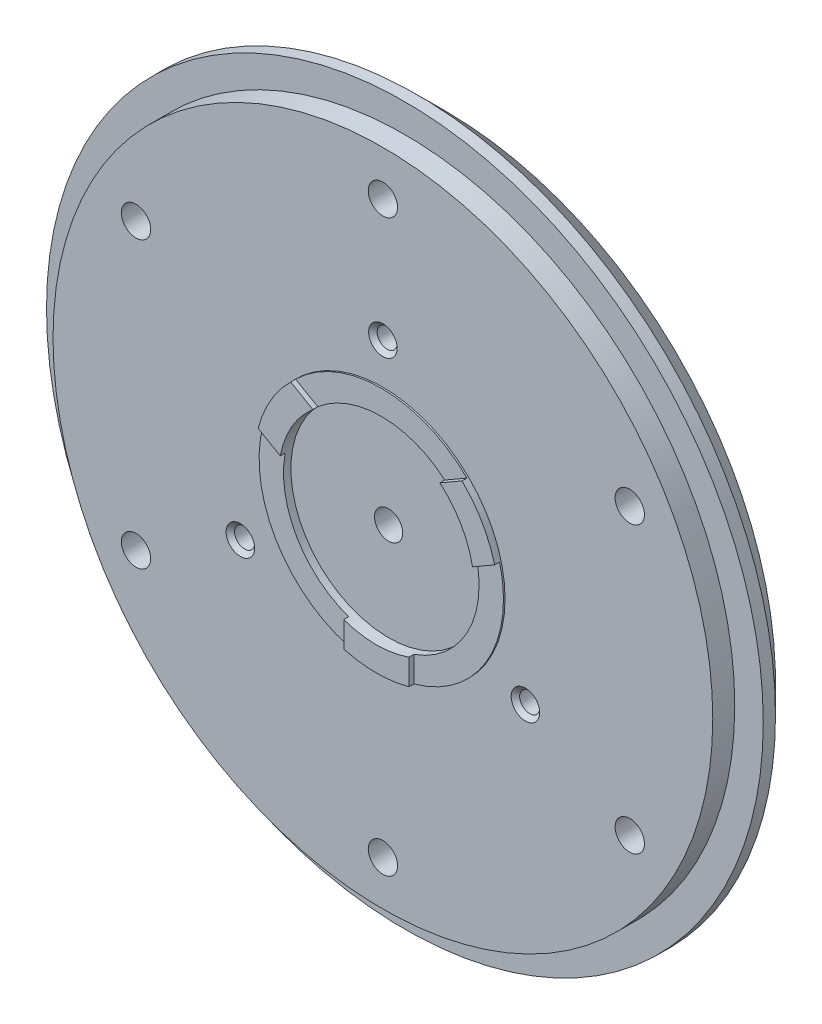
ISO-10303-21;
HEADER;
FILE_DESCRIPTION(('STEP AP214'),'2;1');
FILE_NAME('part.step','',(''),(''),'','','');
FILE_SCHEMA(('AUTOMOTIVE_DESIGN { 1 0 10303 214 1 1 1 1 }'));
ENDSEC;
DATA;
#1=APPLICATION_CONTEXT('core data for automotive mechanical design processes');
#2=APPLICATION_PROTOCOL_DEFINITION('international standard','automotive_design',2000,#1);
#3=PRODUCT_CONTEXT('',#1,'mechanical');
#4=PRODUCT('Part','Part','',(#3));
#5=PRODUCT_RELATED_PRODUCT_CATEGORY('part','',(#4));
#6=PRODUCT_DEFINITION_FORMATION('','',#4);
#7=PRODUCT_DEFINITION_CONTEXT('part definition',#1,'design');
#8=PRODUCT_DEFINITION('design','',#6,#7);
#9=PRODUCT_DEFINITION_SHAPE('','',#8);
#10=(LENGTH_UNIT() NAMED_UNIT(*) SI_UNIT(.MILLI.,.METRE.));
#11=(NAMED_UNIT(*) PLANE_ANGLE_UNIT() SI_UNIT($,.RADIAN.));
#12=(NAMED_UNIT(*) SI_UNIT($,.STERADIAN.) SOLID_ANGLE_UNIT());
#13=UNCERTAINTY_MEASURE_WITH_UNIT(LENGTH_MEASURE(1.E-05),#10,'distance_accuracy_value','');
#14=(GEOMETRIC_REPRESENTATION_CONTEXT(3) GLOBAL_UNCERTAINTY_ASSIGNED_CONTEXT((#13)) GLOBAL_UNIT_ASSIGNED_CONTEXT((#10,
#11,#12)) REPRESENTATION_CONTEXT('',''));
#15=CARTESIAN_POINT('',(0.,0.,0.));
#16=DIRECTION('',(0.,0.,1.));
#17=DIRECTION('',(1.,0.,0.));
#18=AXIS2_PLACEMENT_3D('',#15,#16,#17);
#19=CARTESIAN_POINT('',(-10.5199840255489,10.6925177625382,7.9));
#20=DIRECTION('',(0.5,0.866025403784439,0.));
#21=DIRECTION('',(-0.866025403784439,0.5,0.));
#22=AXIS2_PLACEMENT_3D('',#19,#20,#21);
#23=PLANE('',#22);
#24=DIRECTION('',(-0.866025403784439,0.5,0.));
#25=VECTOR('',#24,1.);
#26=CARTESIAN_POINT('',(-7.79795897113272,9.12095586463014,7.9));
#27=LINE('',#26,#25);
#28=CARTESIAN_POINT('',(-7.79795897113272,9.12095586463013,7.9));
#29=VERTEX_POINT('',#28);
#30=CARTESIAN_POINT('',(-10.5199840255489,10.6925177625382,7.9));
#31=VERTEX_POINT('',#30);
#32=EDGE_CURVE('E128',#29,#31,#27,.T.);
#33=ORIENTED_EDGE('',*,*,#32,.T.);
#34=DIRECTION('',(0.,0.,1.));
#35=VECTOR('',#34,1.);
#36=CARTESIAN_POINT('',(-10.5199840255489,10.6925177625382,7.9));
#37=LINE('',#36,#35);
#38=CARTESIAN_POINT('',(-10.5199840255489,10.6925177625382,8.5));
#39=VERTEX_POINT('',#38);
#40=EDGE_CURVE('E126',#31,#39,#37,.T.);
#41=ORIENTED_EDGE('',*,*,#40,.T.);
#42=DIRECTION('',(-0.866025403784439,0.5,0.));
#43=VECTOR('',#42,1.);
#44=CARTESIAN_POINT('',(-7.79795897113272,9.12095586463014,8.5));
#45=LINE('',#44,#43);
#46=CARTESIAN_POINT('',(-7.79795897113272,9.12095586463013,8.5));
#47=VERTEX_POINT('',#46);
#48=EDGE_CURVE('E124',#47,#39,#45,.T.);
#49=ORIENTED_EDGE('',*,*,#48,.F.);
#50=DIRECTION('',(0.,0.,1.));
#51=VECTOR('',#50,1.);
#52=CARTESIAN_POINT('',(-7.79795897113272,9.12095586463013,7.35));
#53=LINE('',#52,#51);
#54=EDGE_CURVE('E109',#47,#29,#53,.F.);
#55=ORIENTED_EDGE('',*,*,#54,.T.);
#56=EDGE_LOOP('',(#33,#41,#49,#55));
#57=FACE_BOUND('',#56,.T.);
#58=ADVANCED_FACE('F17',(#57),#23,.T.);
#59=CARTESIAN_POINT('',(7.79795897113271,9.12095586463014,7.9));
#60=DIRECTION('',(-0.5,0.866025403784439,0.));
#61=DIRECTION('',(-0.866025403784439,-0.5,0.));
#62=AXIS2_PLACEMENT_3D('',#59,#60,#61);
#63=PLANE('',#62);
#64=DIRECTION('',(-0.866025403784439,-0.5,0.));
#65=VECTOR('',#64,1.);
#66=CARTESIAN_POINT('',(10.5199840255489,10.6925177625382,7.9));
#67=LINE('',#66,#65);
#68=CARTESIAN_POINT('',(10.5199840255489,10.6925177625382,7.9));
#69=VERTEX_POINT('',#68);
#70=CARTESIAN_POINT('',(7.79795897113271,9.12095586463014,7.9));
#71=VERTEX_POINT('',#70);
#72=EDGE_CURVE('E278',#69,#71,#67,.T.);
#73=ORIENTED_EDGE('',*,*,#72,.T.);
#74=DIRECTION('',(0.,0.,1.));
#75=VECTOR('',#74,1.);
#76=CARTESIAN_POINT('',(7.79795897113271,9.12095586463014,7.35));
#77=LINE('',#76,#75);
#78=CARTESIAN_POINT('',(7.79795897113271,9.12095586463014,8.5));
#79=VERTEX_POINT('',#78);
#80=EDGE_CURVE('E119',#71,#79,#77,.T.);
#81=ORIENTED_EDGE('',*,*,#80,.T.);
#82=DIRECTION('',(-0.866025403784439,-0.5,0.));
#83=VECTOR('',#82,1.);
#84=CARTESIAN_POINT('',(10.5199840255489,10.6925177625382,8.5));
#85=LINE('',#84,#83);
#86=CARTESIAN_POINT('',(10.5199840255489,10.6925177625382,8.5));
#87=VERTEX_POINT('',#86);
#88=EDGE_CURVE('E272',#87,#79,#85,.T.);
#89=ORIENTED_EDGE('',*,*,#88,.F.);
#90=DIRECTION('',(0.,0.,1.));
#91=VECTOR('',#90,1.);
#92=CARTESIAN_POINT('',(10.5199840255489,10.6925177625382,7.9));
#93=LINE('',#92,#91);
#94=EDGE_CURVE('E148',#87,#69,#93,.F.);
#95=ORIENTED_EDGE('',*,*,#94,.T.);
#96=EDGE_LOOP('',(#73,#81,#89,#95));
#97=FACE_BOUND('',#96,.T.);
#98=ADVANCED_FACE('F478',(#97),#63,.T.);
#99=CARTESIAN_POINT('',(14.5199840255489,3.76431453226273,7.9));
#100=DIRECTION('',(0.5,-0.866025403784438,0.));
#101=DIRECTION('',(0.866025403784438,0.5,0.));
#102=AXIS2_PLACEMENT_3D('',#99,#100,#101);
#103=PLANE('',#102);
#104=DIRECTION('',(0.866025403784438,0.500000000000001,0.));
#105=VECTOR('',#104,1.);
#106=CARTESIAN_POINT('',(11.7979589711327,2.19275263435463,7.9));
#107=LINE('',#106,#105);
#108=CARTESIAN_POINT('',(11.7979589711327,2.19275263435463,7.9));
#109=VERTEX_POINT('',#108);
#110=CARTESIAN_POINT('',(14.5199840255489,3.76431453226273,7.9));
#111=VERTEX_POINT('',#110);
#112=EDGE_CURVE('E264',#109,#111,#107,.T.);
#113=ORIENTED_EDGE('',*,*,#112,.T.);
#114=DIRECTION('',(0.,0.,1.));
#115=VECTOR('',#114,1.);
#116=CARTESIAN_POINT('',(14.5199840255489,3.76431453226273,7.9));
#117=LINE('',#116,#115);
#118=CARTESIAN_POINT('',(14.5199840255489,3.76431453226273,8.5));
#119=VERTEX_POINT('',#118);
#120=EDGE_CURVE('E144',#111,#119,#117,.T.);
#121=ORIENTED_EDGE('',*,*,#120,.T.);
#122=DIRECTION('',(0.866025403784438,0.500000000000001,0.));
#123=VECTOR('',#122,1.);
#124=CARTESIAN_POINT('',(11.7979589711327,2.19275263435463,8.5));
#125=LINE('',#124,#123);
#126=CARTESIAN_POINT('',(11.7979589711327,2.19275263435463,8.5));
#127=VERTEX_POINT('',#126);
#128=EDGE_CURVE('E271',#127,#119,#125,.T.);
#129=ORIENTED_EDGE('',*,*,#128,.F.);
#130=DIRECTION('',(0.,0.,1.));
#131=VECTOR('',#130,1.);
#132=CARTESIAN_POINT('',(11.7979589711327,2.19275263435463,7.35));
#133=LINE('',#132,#131);
#134=EDGE_CURVE('E146',#127,#109,#133,.F.);
#135=ORIENTED_EDGE('',*,*,#134,.T.);
#136=EDGE_LOOP('',(#113,#121,#129,#135));
#137=FACE_BOUND('',#136,.T.);
#138=ADVANCED_FACE('F475',(#137),#103,.T.);
#139=CARTESIAN_POINT('',(4.,-11.3137084989848,7.9));
#140=DIRECTION('',(1.,0.,0.));
#141=DIRECTION('',(0.,0.,-1.));
#142=AXIS2_PLACEMENT_3D('',#139,#140,#141);
#143=PLANE('',#142);
#144=DIRECTION('',(0.,1.,0.));
#145=VECTOR('',#144,1.);
#146=CARTESIAN_POINT('',(4.,0.,7.9));
#147=LINE('',#146,#145);
#148=CARTESIAN_POINT('',(4.,-14.456832294801,7.9));
#149=VERTEX_POINT('',#148);
#150=CARTESIAN_POINT('',(4.,-11.3137084989848,7.9));
#151=VERTEX_POINT('',#150);
#152=EDGE_CURVE('E268',#149,#151,#147,.T.);
#153=ORIENTED_EDGE('',*,*,#152,.T.);
#154=DIRECTION('',(0.,0.,1.));
#155=VECTOR('',#154,1.);
#156=CARTESIAN_POINT('',(4.,-11.3137084989848,7.35));
#157=LINE('',#156,#155);
#158=CARTESIAN_POINT('',(4.,-11.3137084989848,8.5));
#159=VERTEX_POINT('',#158);
#160=EDGE_CURVE('E136',#151,#159,#157,.T.);
#161=ORIENTED_EDGE('',*,*,#160,.T.);
#162=DIRECTION('',(0.,-1.,0.));
#163=VECTOR('',#162,1.);
#164=CARTESIAN_POINT('',(4.,-13.1468896669297,8.5));
#165=LINE('',#164,#163);
#166=CARTESIAN_POINT('',(4.,-14.456832294801,8.5));
#167=VERTEX_POINT('',#166);
#168=EDGE_CURVE('E290',#167,#159,#165,.F.);
#169=ORIENTED_EDGE('',*,*,#168,.F.);
#170=DIRECTION('',(0.,0.,-1.));
#171=VECTOR('',#170,1.);
#172=CARTESIAN_POINT('',(4.,-14.456832294801,7.9));
#173=LINE('',#172,#171);
#174=EDGE_CURVE('E142',#167,#149,#173,.T.);
#175=ORIENTED_EDGE('',*,*,#174,.T.);
#176=EDGE_LOOP('',(#153,#161,#169,#175));
#177=FACE_BOUND('',#176,.T.);
#178=ADVANCED_FACE('F471',(#177),#143,.T.);
#179=CARTESIAN_POINT('',(-11.7979589711327,2.19275263435462,7.9));
#180=DIRECTION('',(-0.5,-0.866025403784438,0.));
#181=DIRECTION('',(0.866025403784438,-0.5,0.));
#182=AXIS2_PLACEMENT_3D('',#179,#180,#181);
#183=PLANE('',#182);
#184=DIRECTION('',(0.866025403784438,-0.5,0.));
#185=VECTOR('',#184,1.);
#186=CARTESIAN_POINT('',(-14.5199840255489,3.76431453226272,7.9));
#187=LINE('',#186,#185);
#188=CARTESIAN_POINT('',(-14.5199840255489,3.76431453226272,7.9));
#189=VERTEX_POINT('',#188);
#190=CARTESIAN_POINT('',(-11.7979589711327,2.19275263435462,7.9));
#191=VERTEX_POINT('',#190);
#192=EDGE_CURVE('E260',#189,#191,#187,.T.);
#193=ORIENTED_EDGE('',*,*,#192,.T.);
#194=DIRECTION('',(0.,0.,1.));
#195=VECTOR('',#194,1.);
#196=CARTESIAN_POINT('',(-11.7979589711327,2.19275263435462,7.35));
#197=LINE('',#196,#195);
#198=CARTESIAN_POINT('',(-11.7979589711327,2.19275263435462,8.5));
#199=VERTEX_POINT('',#198);
#200=EDGE_CURVE('E120',#191,#199,#197,.T.);
#201=ORIENTED_EDGE('',*,*,#200,.T.);
#202=DIRECTION('',(0.866025403784438,-0.5,0.));
#203=VECTOR('',#202,1.);
#204=CARTESIAN_POINT('',(-14.5199840255489,3.76431453226272,8.5));
#205=LINE('',#204,#203);
#206=CARTESIAN_POINT('',(-14.5199840255489,3.76431453226272,8.5));
#207=VERTEX_POINT('',#206);
#208=EDGE_CURVE('E103',#207,#199,#205,.T.);
#209=ORIENTED_EDGE('',*,*,#208,.F.);
#210=DIRECTION('',(0.,0.,1.));
#211=VECTOR('',#210,1.);
#212=CARTESIAN_POINT('',(-14.5199840255489,3.76431453226272,7.9));
#213=LINE('',#212,#211);
#214=EDGE_CURVE('E139',#207,#189,#213,.F.);
#215=ORIENTED_EDGE('',*,*,#214,.T.);
#216=EDGE_LOOP('',(#193,#201,#209,#215));
#217=FACE_BOUND('',#216,.T.);
#218=ADVANCED_FACE('F467',(#217),#183,.T.);
#219=CARTESIAN_POINT('',(0.,0.,7.35));
#220=DIRECTION('',(0.,0.,1.));
#221=DIRECTION('',(1.,0.,0.));
#222=AXIS2_PLACEMENT_3D('',#219,#220,#221);
#223=CYLINDRICAL_SURFACE('',#222,12.);
#224=CARTESIAN_POINT('',(0.,0.,7.));
#225=DIRECTION('',(0.,0.,1.));
#226=DIRECTION('',(1.,0.,0.));
#227=AXIS2_PLACEMENT_3D('',#224,#225,#226);
#228=CIRCLE('',#227,12.);
#229=CARTESIAN_POINT('',(12.,0.,7.));
#230=VERTEX_POINT('',#229);
#231=EDGE_CURVE('E20',#230,#230,#228,.F.);
#232=ORIENTED_EDGE('',*,*,#231,.T.);
#233=EDGE_LOOP('',(#232));
#234=FACE_BOUND('',#233,.T.);
#235=ORIENTED_EDGE('',*,*,#200,.F.);
#236=CARTESIAN_POINT('',(0.,0.,7.9));
#237=DIRECTION('',(0.,0.,1.));
#238=DIRECTION('',(1.,0.,0.));
#239=AXIS2_PLACEMENT_3D('',#236,#237,#238);
#240=CIRCLE('',#239,12.);
#241=CARTESIAN_POINT('',(-4.,-11.3137084989848,7.9));
#242=VERTEX_POINT('',#241);
#243=EDGE_CURVE('E257',#191,#242,#240,.T.);
#244=ORIENTED_EDGE('',*,*,#243,.T.);
#245=DIRECTION('',(0.,0.,1.));
#246=VECTOR('',#245,1.);
#247=CARTESIAN_POINT('',(-4.,-11.3137084989848,7.9));
#248=LINE('',#247,#246);
#249=CARTESIAN_POINT('',(-4.,-11.3137084989848,8.5));
#250=VERTEX_POINT('',#249);
#251=EDGE_CURVE('E134',#250,#242,#248,.F.);
#252=ORIENTED_EDGE('',*,*,#251,.F.);
#253=CARTESIAN_POINT('',(0.,0.,8.5));
#254=DIRECTION('',(0.,0.,1.));
#255=DIRECTION('',(1.,0.,0.));
#256=AXIS2_PLACEMENT_3D('',#253,#254,#255);
#257=CIRCLE('',#256,12.);
#258=EDGE_CURVE('E261',#159,#250,#257,.F.);
#259=ORIENTED_EDGE('',*,*,#258,.F.);
#260=ORIENTED_EDGE('',*,*,#160,.F.);
#261=CARTESIAN_POINT('',(0.,0.,7.9));
#262=DIRECTION('',(0.,0.,1.));
#263=DIRECTION('',(1.,0.,0.));
#264=AXIS2_PLACEMENT_3D('',#261,#262,#263);
#265=CIRCLE('',#264,12.);
#266=EDGE_CURVE('E265',#151,#109,#265,.T.);
#267=ORIENTED_EDGE('',*,*,#266,.T.);
#268=ORIENTED_EDGE('',*,*,#134,.F.);
#269=CARTESIAN_POINT('',(0.,0.,8.5));
#270=DIRECTION('',(0.,0.,1.));
#271=DIRECTION('',(1.,0.,0.));
#272=AXIS2_PLACEMENT_3D('',#269,#270,#271);
#273=CIRCLE('',#272,12.);
#274=EDGE_CURVE('E269',#79,#127,#273,.F.);
#275=ORIENTED_EDGE('',*,*,#274,.F.);
#276=ORIENTED_EDGE('',*,*,#80,.F.);
#277=CARTESIAN_POINT('',(0.,0.,7.9));
#278=DIRECTION('',(0.,0.,1.));
#279=DIRECTION('',(1.,0.,0.));
#280=AXIS2_PLACEMENT_3D('',#277,#278,#279);
#281=CIRCLE('',#280,12.);
#282=EDGE_CURVE('E114',#71,#29,#281,.T.);
#283=ORIENTED_EDGE('',*,*,#282,.T.);
#284=ORIENTED_EDGE('',*,*,#54,.F.);
#285=CARTESIAN_POINT('',(0.,0.,8.5));
#286=DIRECTION('',(0.,0.,1.));
#287=DIRECTION('',(1.,0.,0.));
#288=AXIS2_PLACEMENT_3D('',#285,#286,#287);
#289=CIRCLE('',#288,12.);
#290=EDGE_CURVE('E112',#199,#47,#289,.F.);
#291=ORIENTED_EDGE('',*,*,#290,.F.);
#292=EDGE_LOOP('',(#235,#244,#252,#259,#260,#267,#268,#275,#276,#283,#284,#291));
#293=FACE_BOUND('',#292,.T.);
#294=ADVANCED_FACE('F111',(#234,#293),#223,.F.);
#295=CARTESIAN_POINT('',(-4.,-14.456832294801,7.9));
#296=DIRECTION('',(-1.,0.,0.));
#297=DIRECTION('',(0.,-1.,0.));
#298=AXIS2_PLACEMENT_3D('',#295,#296,#297);
#299=PLANE('',#298);
#300=DIRECTION('',(0.,1.,0.));
#301=VECTOR('',#300,1.);
#302=CARTESIAN_POINT('',(-4.,0.,7.9));
#303=LINE('',#302,#301);
#304=CARTESIAN_POINT('',(-4.,-14.456832294801,7.9));
#305=VERTEX_POINT('',#304);
#306=EDGE_CURVE('E256',#242,#305,#303,.F.);
#307=ORIENTED_EDGE('',*,*,#306,.T.);
#308=DIRECTION('',(0.,0.,1.));
#309=VECTOR('',#308,1.);
#310=CARTESIAN_POINT('',(-4.,-14.456832294801,7.9));
#311=LINE('',#310,#309);
#312=CARTESIAN_POINT('',(-4.,-14.456832294801,8.5));
#313=VERTEX_POINT('',#312);
#314=EDGE_CURVE('E35',#305,#313,#311,.T.);
#315=ORIENTED_EDGE('',*,*,#314,.T.);
#316=DIRECTION('',(0.,-1.,0.));
#317=VECTOR('',#316,1.);
#318=CARTESIAN_POINT('',(-4.,-13.1468896669297,8.5));
#319=LINE('',#318,#317);
#320=EDGE_CURVE('E263',#250,#313,#319,.T.);
#321=ORIENTED_EDGE('',*,*,#320,.F.);
#322=ORIENTED_EDGE('',*,*,#251,.T.);
#323=EDGE_LOOP('',(#307,#315,#321,#322));
#324=FACE_BOUND('',#323,.T.);
#325=ADVANCED_FACE('F460',(#324),#299,.T.);
#326=CARTESIAN_POINT('',(0.,0.,7.));
#327=DIRECTION('',(0.,0.,-1.));
#328=DIRECTION('',(-1.,0.,0.));
#329=AXIS2_PLACEMENT_3D('',#326,#327,#328);
#330=PLANE('',#329);
#331=ORIENTED_EDGE('',*,*,#231,.F.);
#332=EDGE_LOOP('',(#331));
#333=FACE_BOUND('',#332,.T.);
#334=CARTESIAN_POINT('',(0.,0.,7.));
#335=DIRECTION('',(0.,0.,-1.));
#336=DIRECTION('',(-1.,0.,0.));
#337=AXIS2_PLACEMENT_3D('',#334,#335,#336);
#338=CIRCLE('',#337,1.7295);
#339=CARTESIAN_POINT('',(-1.7295,0.,7.));
#340=VERTEX_POINT('',#339);
#341=EDGE_CURVE('E253',#340,#340,#338,.T.);
#342=ORIENTED_EDGE('',*,*,#341,.T.);
#343=EDGE_LOOP('',(#342));
#344=FACE_BOUND('',#343,.T.);
#345=ADVANCED_FACE('F457',(#333,#344),#330,.F.);
#346=CARTESIAN_POINT('',(-11.3855404323122,6.57344483346484,8.5));
#347=DIRECTION('',(0.,0.,1.));
#348=DIRECTION('',(0.,-1.,0.));
#349=AXIS2_PLACEMENT_3D('',#346,#347,#348);
#350=PLANE('',#349);
#351=ORIENTED_EDGE('',*,*,#290,.T.);
#352=ORIENTED_EDGE('',*,*,#48,.T.);
#353=CARTESIAN_POINT('',(0.,0.,8.5));
#354=DIRECTION('',(0.,0.,1.));
#355=DIRECTION('',(1.,0.,0.));
#356=AXIS2_PLACEMENT_3D('',#353,#354,#355);
#357=CIRCLE('',#356,15.);
#358=EDGE_CURVE('E248',#207,#39,#357,.F.);
#359=ORIENTED_EDGE('',*,*,#358,.F.);
#360=ORIENTED_EDGE('',*,*,#208,.T.);
#361=EDGE_LOOP('',(#351,#352,#359,#360));
#362=FACE_BOUND('',#361,.T.);
#363=ADVANCED_FACE('F123',(#362),#350,.T.);
#364=CARTESIAN_POINT('',(0.,0.,7.9));
#365=DIRECTION('',(0.,0.,-1.));
#366=DIRECTION('',(-1.,0.,0.));
#367=AXIS2_PLACEMENT_3D('',#364,#365,#366);
#368=PLANE('',#367);
#369=CARTESIAN_POINT('',(0.,0.,7.9));
#370=DIRECTION('',(0.,0.,1.));
#371=DIRECTION('',(1.,0.,0.));
#372=AXIS2_PLACEMENT_3D('',#369,#370,#371);
#373=CIRCLE('',#372,15.);
#374=EDGE_CURVE('E245',#31,#69,#373,.F.);
#375=ORIENTED_EDGE('',*,*,#374,.F.);
#376=ORIENTED_EDGE('',*,*,#32,.F.);
#377=ORIENTED_EDGE('',*,*,#282,.F.);
#378=ORIENTED_EDGE('',*,*,#72,.F.);
#379=EDGE_LOOP('',(#375,#376,#377,#378));
#380=FACE_BOUND('',#379,.T.);
#381=ADVANCED_FACE('F451',(#380),#368,.F.);
#382=CARTESIAN_POINT('',(11.3855404323122,6.57344483346484,8.5));
#383=DIRECTION('',(0.,0.,1.));
#384=DIRECTION('',(0.,-1.,0.));
#385=AXIS2_PLACEMENT_3D('',#382,#383,#384);
#386=PLANE('',#385);
#387=ORIENTED_EDGE('',*,*,#128,.T.);
#388=CARTESIAN_POINT('',(0.,0.,8.5));
#389=DIRECTION('',(0.,0.,1.));
#390=DIRECTION('',(1.,0.,0.));
#391=AXIS2_PLACEMENT_3D('',#388,#389,#390);
#392=CIRCLE('',#391,15.);
#393=EDGE_CURVE('E242',#87,#119,#392,.F.);
#394=ORIENTED_EDGE('',*,*,#393,.F.);
#395=ORIENTED_EDGE('',*,*,#88,.T.);
#396=ORIENTED_EDGE('',*,*,#274,.T.);
#397=EDGE_LOOP('',(#387,#394,#395,#396));
#398=FACE_BOUND('',#397,.T.);
#399=ADVANCED_FACE('F447',(#398),#386,.T.);
#400=CARTESIAN_POINT('',(0.,0.,7.9));
#401=DIRECTION('',(0.,0.,-1.));
#402=DIRECTION('',(-1.,0.,0.));
#403=AXIS2_PLACEMENT_3D('',#400,#401,#402);
#404=PLANE('',#403);
#405=ORIENTED_EDGE('',*,*,#266,.F.);
#406=ORIENTED_EDGE('',*,*,#152,.F.);
#407=CARTESIAN_POINT('',(0.,0.,7.9));
#408=DIRECTION('',(0.,0.,1.));
#409=DIRECTION('',(1.,0.,0.));
#410=AXIS2_PLACEMENT_3D('',#407,#408,#409);
#411=CIRCLE('',#410,15.);
#412=EDGE_CURVE('E239',#111,#149,#411,.F.);
#413=ORIENTED_EDGE('',*,*,#412,.F.);
#414=ORIENTED_EDGE('',*,*,#112,.F.);
#415=EDGE_LOOP('',(#405,#406,#413,#414));
#416=FACE_BOUND('',#415,.T.);
#417=ADVANCED_FACE('F443',(#416),#404,.F.);
#418=CARTESIAN_POINT('',(0.,-13.1468896669297,8.5));
#419=DIRECTION('',(0.,0.,1.));
#420=DIRECTION('',(0.,-1.,0.));
#421=AXIS2_PLACEMENT_3D('',#418,#419,#420);
#422=PLANE('',#421);
#423=CARTESIAN_POINT('',(0.,0.,8.5));
#424=DIRECTION('',(0.,0.,1.));
#425=DIRECTION('',(1.,0.,0.));
#426=AXIS2_PLACEMENT_3D('',#423,#424,#425);
#427=CIRCLE('',#426,15.);
#428=EDGE_CURVE('E237',#167,#313,#427,.F.);
#429=ORIENTED_EDGE('',*,*,#428,.F.);
#430=ORIENTED_EDGE('',*,*,#168,.T.);
#431=ORIENTED_EDGE('',*,*,#258,.T.);
#432=ORIENTED_EDGE('',*,*,#320,.T.);
#433=EDGE_LOOP('',(#429,#430,#431,#432));
#434=FACE_BOUND('',#433,.T.);
#435=ADVANCED_FACE('F439',(#434),#422,.T.);
#436=CARTESIAN_POINT('',(0.,0.,7.9));
#437=DIRECTION('',(0.,0.,-1.));
#438=DIRECTION('',(-1.,0.,0.));
#439=AXIS2_PLACEMENT_3D('',#436,#437,#438);
#440=PLANE('',#439);
#441=ORIENTED_EDGE('',*,*,#243,.F.);
#442=ORIENTED_EDGE('',*,*,#192,.F.);
#443=CARTESIAN_POINT('',(0.,0.,7.9));
#444=DIRECTION('',(0.,0.,1.));
#445=DIRECTION('',(1.,0.,0.));
#446=AXIS2_PLACEMENT_3D('',#443,#444,#445);
#447=CIRCLE('',#446,15.);
#448=EDGE_CURVE('E235',#305,#189,#447,.F.);
#449=ORIENTED_EDGE('',*,*,#448,.F.);
#450=ORIENTED_EDGE('',*,*,#306,.F.);
#451=EDGE_LOOP('',(#441,#442,#449,#450));
#452=FACE_BOUND('',#451,.T.);
#453=ADVANCED_FACE('F435',(#452),#440,.F.);
#454=CARTESIAN_POINT('',(0.,0.,5.));
#455=DIRECTION('',(0.,0.,-1.));
#456=DIRECTION('',(-1.,0.,0.));
#457=AXIS2_PLACEMENT_3D('',#454,#455,#456);
#458=PLANE('',#457);
#459=CARTESIAN_POINT('',(0.,0.,5.));
#460=DIRECTION('',(0.,0.,1.));
#461=DIRECTION('',(1.,0.,0.));
#462=AXIS2_PLACEMENT_3D('',#459,#460,#461);
#463=CIRCLE('',#462,44.);
#464=CARTESIAN_POINT('',(44.,0.,5.));
#465=VERTEX_POINT('',#464);
#466=EDGE_CURVE('E250',#465,#465,#463,.F.);
#467=ORIENTED_EDGE('',*,*,#466,.F.);
#468=EDGE_LOOP('',(#467));
#469=FACE_BOUND('',#468,.T.);
#470=CARTESIAN_POINT('',(0.,0.,5.));
#471=DIRECTION('',(0.,0.,1.));
#472=DIRECTION('',(1.,0.,0.));
#473=AXIS2_PLACEMENT_3D('',#470,#471,#472);
#474=CIRCLE('',#473,40.5);
#475=CARTESIAN_POINT('',(40.5,0.,5.));
#476=VERTEX_POINT('',#475);
#477=EDGE_CURVE('E231',#476,#476,#474,.T.);
#478=ORIENTED_EDGE('',*,*,#477,.F.);
#479=EDGE_LOOP('',(#478));
#480=FACE_BOUND('',#479,.T.);
#481=ADVANCED_FACE('F431',(#469,#480),#458,.F.);
#482=CARTESIAN_POINT('',(0.,0.,7.3));
#483=DIRECTION('',(0.,0.,-1.));
#484=DIRECTION('',(-1.,0.,0.));
#485=AXIS2_PLACEMENT_3D('',#482,#483,#484);
#486=CYLINDRICAL_SURFACE('',#485,1.7295);
#487=ORIENTED_EDGE('',*,*,#341,.F.);
#488=EDGE_LOOP('',(#487));
#489=FACE_BOUND('',#488,.T.);
#490=CARTESIAN_POINT('',(0.,0.,3.07049999997844));
#491=DIRECTION('',(0.,0.,-1.));
#492=DIRECTION('',(-1.,0.,0.));
#493=AXIS2_PLACEMENT_3D('',#490,#491,#492);
#494=CIRCLE('',#493,1.72949999995353);
#495=CARTESIAN_POINT('',(-1.72949999995353,0.,3.07049999997844));
#496=VERTEX_POINT('',#495);
#497=EDGE_CURVE('E234',#496,#496,#494,.T.);
#498=ORIENTED_EDGE('',*,*,#497,.T.);
#499=EDGE_LOOP('',(#498));
#500=FACE_BOUND('',#499,.T.);
#501=ADVANCED_FACE('F427',(#489,#500),#486,.F.);
#502=CARTESIAN_POINT('',(0.,0.,0.));
#503=DIRECTION('',(0.,0.,1.));
#504=DIRECTION('',(1.,0.,0.));
#505=AXIS2_PLACEMENT_3D('',#502,#503,#504);
#506=CYLINDRICAL_SURFACE('',#505,44.);
#507=CARTESIAN_POINT('',(0.,0.,3.5));
#508=DIRECTION('',(0.,0.,1.));
#509=DIRECTION('',(-1.,0.,0.));
#510=AXIS2_PLACEMENT_3D('',#507,#508,#509);
#511=CIRCLE('',#510,44.);
#512=CARTESIAN_POINT('',(-44.,0.,3.5));
#513=VERTEX_POINT('',#512);
#514=EDGE_CURVE('E230',#513,#513,#511,.F.);
#515=ORIENTED_EDGE('',*,*,#514,.F.);
#516=EDGE_LOOP('',(#515));
#517=FACE_BOUND('',#516,.T.);
#518=ORIENTED_EDGE('',*,*,#466,.T.);
#519=EDGE_LOOP('',(#518));
#520=FACE_BOUND('',#519,.T.);
#521=ADVANCED_FACE('F423',(#517,#520),#506,.T.);
#522=CARTESIAN_POINT('',(0.,0.,7.7));
#523=DIRECTION('',(0.,0.,1.));
#524=DIRECTION('',(1.,0.,0.));
#525=AXIS2_PLACEMENT_3D('',#522,#523,#524);
#526=CYLINDRICAL_SURFACE('',#525,15.);
#527=CARTESIAN_POINT('',(0.,0.,7.7));
#528=DIRECTION('',(0.,0.,1.));
#529=DIRECTION('',(1.,0.,0.));
#530=AXIS2_PLACEMENT_3D('',#527,#528,#529);
#531=CIRCLE('',#530,15.);
#532=CARTESIAN_POINT('',(15.,0.,7.7));
#533=VERTEX_POINT('',#532);
#534=EDGE_CURVE('E218',#533,#533,#531,.T.);
#535=ORIENTED_EDGE('',*,*,#534,.T.);
#536=EDGE_LOOP('',(#535));
#537=FACE_BOUND('',#536,.T.);
#538=ORIENTED_EDGE('',*,*,#314,.F.);
#539=ORIENTED_EDGE('',*,*,#448,.T.);
#540=ORIENTED_EDGE('',*,*,#214,.F.);
#541=ORIENTED_EDGE('',*,*,#358,.T.);
#542=ORIENTED_EDGE('',*,*,#40,.F.);
#543=ORIENTED_EDGE('',*,*,#374,.T.);
#544=ORIENTED_EDGE('',*,*,#94,.F.);
#545=ORIENTED_EDGE('',*,*,#393,.T.);
#546=ORIENTED_EDGE('',*,*,#120,.F.);
#547=ORIENTED_EDGE('',*,*,#412,.T.);
#548=ORIENTED_EDGE('',*,*,#174,.F.);
#549=ORIENTED_EDGE('',*,*,#428,.T.);
#550=EDGE_LOOP('',(#538,#539,#540,#541,#542,#543,#544,#545,#546,#547,#548,#549));
#551=FACE_BOUND('',#550,.T.);
#552=ADVANCED_FACE('F419',(#537,#551),#526,.T.);
#553=CARTESIAN_POINT('',(0.,0.,5.));
#554=DIRECTION('',(0.,0.,1.));
#555=DIRECTION('',(1.,0.,0.));
#556=AXIS2_PLACEMENT_3D('',#553,#554,#555);
#557=CYLINDRICAL_SURFACE('',#556,40.5);
#558=ORIENTED_EDGE('',*,*,#477,.T.);
#559=EDGE_LOOP('',(#558));
#560=FACE_BOUND('',#559,.T.);
#561=CARTESIAN_POINT('',(0.,0.,7.7));
#562=DIRECTION('',(0.,0.,1.));
#563=DIRECTION('',(1.,0.,0.));
#564=AXIS2_PLACEMENT_3D('',#561,#562,#563);
#565=CIRCLE('',#564,40.5);
#566=CARTESIAN_POINT('',(40.5,0.,7.7));
#567=VERTEX_POINT('',#566);
#568=EDGE_CURVE('E215',#567,#567,#565,.F.);
#569=ORIENTED_EDGE('',*,*,#568,.T.);
#570=EDGE_LOOP('',(#569));
#571=FACE_BOUND('',#570,.T.);
#572=ADVANCED_FACE('F415',(#560,#571),#557,.T.);
#573=CARTESIAN_POINT('',(0.,0.,2.29999999999109));
#574=DIRECTION('',(0.,0.,-1.));
#575=DIRECTION('',(-1.,0.,0.));
#576=AXIS2_PLACEMENT_3D('',#573,#574,#575);
#577=CONICAL_SURFACE('',#576,2.49999999999773,0.785398163434336);
#578=ORIENTED_EDGE('',*,*,#497,.F.);
#579=EDGE_LOOP('',(#578));
#580=FACE_BOUND('',#579,.T.);
#581=CARTESIAN_POINT('',(0.,0.,2.29999999999109));
#582=DIRECTION('',(0.,0.,-1.));
#583=DIRECTION('',(-1.,0.,0.));
#584=AXIS2_PLACEMENT_3D('',#581,#582,#583);
#585=CIRCLE('',#584,2.49999999999773);
#586=CARTESIAN_POINT('',(-2.49999999999773,0.,2.29999999999109));
#587=VERTEX_POINT('',#586);
#588=EDGE_CURVE('E212',#587,#587,#585,.T.);
#589=ORIENTED_EDGE('',*,*,#588,.T.);
#590=EDGE_LOOP('',(#589));
#591=FACE_BOUND('',#590,.T.);
#592=ADVANCED_FACE('F411',(#580,#591),#577,.F.);
#593=CARTESIAN_POINT('',(0.,0.,3.5));
#594=DIRECTION('',(0.,0.,1.));
#595=DIRECTION('',(0.,-1.,0.));
#596=AXIS2_PLACEMENT_3D('',#593,#594,#595);
#597=CONICAL_SURFACE('',#596,44.,0.785398163397448);
#598=CARTESIAN_POINT('',(0.,0.,0.));
#599=DIRECTION('',(0.,0.,1.));
#600=DIRECTION('',(0.,-1.,0.));
#601=AXIS2_PLACEMENT_3D('',#598,#599,#600);
#602=CIRCLE('',#601,40.5);
#603=CARTESIAN_POINT('',(0.,-40.5,0.));
#604=VERTEX_POINT('',#603);
#605=EDGE_CURVE('E208',#604,#604,#602,.F.);
#606=ORIENTED_EDGE('',*,*,#605,.F.);
#607=EDGE_LOOP('',(#606));
#608=FACE_BOUND('',#607,.T.);
#609=ORIENTED_EDGE('',*,*,#514,.T.);
#610=EDGE_LOOP('',(#609));
#611=FACE_BOUND('',#610,.T.);
#612=ADVANCED_FACE('F385',(#608,#611),#597,.T.);
#613=CARTESIAN_POINT('',(17.5,-10.,7.69999999988613));
#614=DIRECTION('',(0.,0.,1.));
#615=DIRECTION('',(0.,-1.,0.));
#616=AXIS2_PLACEMENT_3D('',#613,#614,#615);
#617=CONICAL_SURFACE('',#616,1.74999999988586,0.785398163397448);
#618=CARTESIAN_POINT('',(17.5,-10.,7.1795));
#619=DIRECTION('',(0.,0.,1.));
#620=DIRECTION('',(1.,0.,0.));
#621=AXIS2_PLACEMENT_3D('',#618,#619,#620);
#622=CIRCLE('',#621,1.2295);
#623=CARTESIAN_POINT('',(18.7295,-10.,7.1795));
#624=VERTEX_POINT('',#623);
#625=EDGE_CURVE('E211',#624,#624,#622,.F.);
#626=ORIENTED_EDGE('',*,*,#625,.T.);
#627=EDGE_LOOP('',(#626));
#628=FACE_BOUND('',#627,.T.);
#629=CARTESIAN_POINT('',(17.5,-10.,7.69999999999982));
#630=DIRECTION('',(0.,0.,1.));
#631=DIRECTION('',(0.,-1.,0.));
#632=AXIS2_PLACEMENT_3D('',#629,#630,#631);
#633=CIRCLE('',#632,1.74999999999954);
#634=CARTESIAN_POINT('',(17.5,-11.7499999999995,7.69999999999982));
#635=VERTEX_POINT('',#634);
#636=EDGE_CURVE('E227',#635,#635,#633,.T.);
#637=ORIENTED_EDGE('',*,*,#636,.T.);
#638=EDGE_LOOP('',(#637));
#639=FACE_BOUND('',#638,.T.);
#640=ADVANCED_FACE('F381',(#628,#639),#617,.F.);
#641=CARTESIAN_POINT('',(0.,20.,7.69999999994297));
#642=DIRECTION('',(0.,0.,1.));
#643=DIRECTION('',(1.,0.,0.));
#644=AXIS2_PLACEMENT_3D('',#641,#642,#643);
#645=CONICAL_SURFACE('',#644,1.74999999995862,0.785398163397448);
#646=CARTESIAN_POINT('',(0.,20.,7.1795));
#647=DIRECTION('',(0.,0.,1.));
#648=DIRECTION('',(1.,0.,0.));
#649=AXIS2_PLACEMENT_3D('',#646,#647,#648);
#650=CIRCLE('',#649,1.2295);
#651=CARTESIAN_POINT('',(1.2295,20.,7.1795));
#652=VERTEX_POINT('',#651);
#653=EDGE_CURVE('E302',#652,#652,#650,.F.);
#654=ORIENTED_EDGE('',*,*,#653,.T.);
#655=EDGE_LOOP('',(#654));
#656=FACE_BOUND('',#655,.T.);
#657=CARTESIAN_POINT('',(0.,20.,7.69999999999982));
#658=DIRECTION('',(0.,0.,1.));
#659=DIRECTION('',(1.,0.,0.));
#660=AXIS2_PLACEMENT_3D('',#657,#658,#659);
#661=CIRCLE('',#660,1.75000000001546);
#662=CARTESIAN_POINT('',(1.75000000001546,20.,7.69999999999982));
#663=VERTEX_POINT('',#662);
#664=EDGE_CURVE('E224',#663,#663,#661,.T.);
#665=ORIENTED_EDGE('',*,*,#664,.T.);
#666=EDGE_LOOP('',(#665));
#667=FACE_BOUND('',#666,.T.);
#668=ADVANCED_FACE('F384',(#656,#667),#645,.F.);
#669=CARTESIAN_POINT('',(-17.5,-10.,7.69999999994297));
#670=DIRECTION('',(0.,0.,1.));
#671=DIRECTION('',(1.,0.,0.));
#672=AXIS2_PLACEMENT_3D('',#669,#670,#671);
#673=CONICAL_SURFACE('',#672,1.74999999986085,0.785398163397448);
#674=CARTESIAN_POINT('',(-17.5,-10.,7.1795));
#675=DIRECTION('',(0.,0.,1.));
#676=DIRECTION('',(1.,0.,0.));
#677=AXIS2_PLACEMENT_3D('',#674,#675,#676);
#678=CIRCLE('',#677,1.2295);
#679=CARTESIAN_POINT('',(-16.2705,-10.,7.1795));
#680=VERTEX_POINT('',#679);
#681=EDGE_CURVE('E207',#680,#680,#678,.F.);
#682=ORIENTED_EDGE('',*,*,#681,.T.);
#683=EDGE_LOOP('',(#682));
#684=FACE_BOUND('',#683,.T.);
#685=CARTESIAN_POINT('',(-17.5,-10.,7.69999999999982));
#686=DIRECTION('',(0.,0.,1.));
#687=DIRECTION('',(1.,0.,0.));
#688=AXIS2_PLACEMENT_3D('',#685,#686,#687);
#689=CIRCLE('',#688,1.74999999991769);
#690=CARTESIAN_POINT('',(-15.7500000000823,-10.,7.69999999999982));
#691=VERTEX_POINT('',#690);
#692=EDGE_CURVE('E221',#691,#691,#689,.T.);
#693=ORIENTED_EDGE('',*,*,#692,.T.);
#694=EDGE_LOOP('',(#693));
#695=FACE_BOUND('',#694,.T.);
#696=ADVANCED_FACE('F308',(#684,#695),#673,.F.);
#697=CARTESIAN_POINT('',(0.,0.,7.7));
#698=DIRECTION('',(0.,0.,-1.));
#699=DIRECTION('',(-1.,0.,0.));
#700=AXIS2_PLACEMENT_3D('',#697,#698,#699);
#701=PLANE('',#700);
#702=ORIENTED_EDGE('',*,*,#568,.F.);
#703=EDGE_LOOP('',(#702));
#704=FACE_BOUND('',#703,.T.);
#705=ORIENTED_EDGE('',*,*,#534,.F.);
#706=EDGE_LOOP('',(#705));
#707=FACE_BOUND('',#706,.T.);
#708=CARTESIAN_POINT('',(30.3108891324554,-17.5,7.7));
#709=DIRECTION('',(0.,0.,-1.));
#710=DIRECTION('',(-1.,0.,0.));
#711=AXIS2_PLACEMENT_3D('',#708,#709,#710);
#712=CIRCLE('',#711,1.8);
#713=CARTESIAN_POINT('',(28.5108891324554,-17.5,7.7));
#714=VERTEX_POINT('',#713);
#715=EDGE_CURVE('E189',#714,#714,#712,.T.);
#716=ORIENTED_EDGE('',*,*,#715,.T.);
#717=EDGE_LOOP('',(#716));
#718=FACE_BOUND('',#717,.T.);
#719=CARTESIAN_POINT('',(0.,-35.,7.7));
#720=DIRECTION('',(0.,0.,-1.));
#721=DIRECTION('',(-1.,0.,0.));
#722=AXIS2_PLACEMENT_3D('',#719,#720,#721);
#723=CIRCLE('',#722,1.8);
#724=CARTESIAN_POINT('',(-1.8,-35.,7.7));
#725=VERTEX_POINT('',#724);
#726=EDGE_CURVE('E192',#725,#725,#723,.T.);
#727=ORIENTED_EDGE('',*,*,#726,.T.);
#728=EDGE_LOOP('',(#727));
#729=FACE_BOUND('',#728,.T.);
#730=CARTESIAN_POINT('',(-30.3108891324554,17.5,7.7));
#731=DIRECTION('',(0.,0.,-1.));
#732=DIRECTION('',(-1.,0.,0.));
#733=AXIS2_PLACEMENT_3D('',#730,#731,#732);
#734=CIRCLE('',#733,1.8);
#735=CARTESIAN_POINT('',(-32.1108891324553,17.5,7.7));
#736=VERTEX_POINT('',#735);
#737=EDGE_CURVE('E195',#736,#736,#734,.T.);
#738=ORIENTED_EDGE('',*,*,#737,.T.);
#739=EDGE_LOOP('',(#738));
#740=FACE_BOUND('',#739,.T.);
#741=CARTESIAN_POINT('',(0.,35.,7.7));
#742=DIRECTION('',(0.,0.,-1.));
#743=DIRECTION('',(-1.,0.,0.));
#744=AXIS2_PLACEMENT_3D('',#741,#742,#743);
#745=CIRCLE('',#744,1.8);
#746=CARTESIAN_POINT('',(-1.8,35.,7.7));
#747=VERTEX_POINT('',#746);
#748=EDGE_CURVE('E198',#747,#747,#745,.T.);
#749=ORIENTED_EDGE('',*,*,#748,.T.);
#750=EDGE_LOOP('',(#749));
#751=FACE_BOUND('',#750,.T.);
#752=CARTESIAN_POINT('',(-30.3108891324554,-17.5,7.7));
#753=DIRECTION('',(0.,0.,-1.));
#754=DIRECTION('',(-1.,0.,0.));
#755=AXIS2_PLACEMENT_3D('',#752,#753,#754);
#756=CIRCLE('',#755,1.8);
#757=CARTESIAN_POINT('',(-32.1108891324554,-17.5,7.7));
#758=VERTEX_POINT('',#757);
#759=EDGE_CURVE('E201',#758,#758,#756,.T.);
#760=ORIENTED_EDGE('',*,*,#759,.T.);
#761=EDGE_LOOP('',(#760));
#762=FACE_BOUND('',#761,.T.);
#763=CARTESIAN_POINT('',(30.3108891324554,17.5,7.7));
#764=DIRECTION('',(0.,0.,-1.));
#765=DIRECTION('',(-1.,0.,0.));
#766=AXIS2_PLACEMENT_3D('',#763,#764,#765);
#767=CIRCLE('',#766,1.8);
#768=CARTESIAN_POINT('',(28.5108891324554,17.5,7.7));
#769=VERTEX_POINT('',#768);
#770=EDGE_CURVE('E204',#769,#769,#767,.T.);
#771=ORIENTED_EDGE('',*,*,#770,.T.);
#772=EDGE_LOOP('',(#771));
#773=FACE_BOUND('',#772,.T.);
#774=ORIENTED_EDGE('',*,*,#692,.F.);
#775=EDGE_LOOP('',(#774));
#776=FACE_BOUND('',#775,.T.);
#777=ORIENTED_EDGE('',*,*,#664,.F.);
#778=EDGE_LOOP('',(#777));
#779=FACE_BOUND('',#778,.T.);
#780=ORIENTED_EDGE('',*,*,#636,.F.);
#781=EDGE_LOOP('',(#780));
#782=FACE_BOUND('',#781,.T.);
#783=ADVANCED_FACE('F389',(#704,#707,#718,#729,#740,#751,#762,#773,#776,#779,#782),#701,.F.);
#784=CARTESIAN_POINT('',(0.,0.,2.3));
#785=DIRECTION('',(0.,0.,1.));
#786=DIRECTION('',(1.,0.,0.));
#787=AXIS2_PLACEMENT_3D('',#784,#785,#786);
#788=PLANE('',#787);
#789=CARTESIAN_POINT('',(0.,0.,2.3));
#790=DIRECTION('',(0.,0.,-1.));
#791=DIRECTION('',(-1.,0.,0.));
#792=AXIS2_PLACEMENT_3D('',#789,#790,#791);
#793=CIRCLE('',#792,5.);
#794=CARTESIAN_POINT('',(-5.,0.,2.3));
#795=VERTEX_POINT('',#794);
#796=EDGE_CURVE('E186',#795,#795,#793,.F.);
#797=ORIENTED_EDGE('',*,*,#796,.F.);
#798=EDGE_LOOP('',(#797));
#799=FACE_BOUND('',#798,.T.);
#800=ORIENTED_EDGE('',*,*,#588,.F.);
#801=EDGE_LOOP('',(#800));
#802=FACE_BOUND('',#801,.T.);
#803=ADVANCED_FACE('F391',(#799,#802),#788,.F.);
#804=CARTESIAN_POINT('',(0.,0.,0.));
#805=DIRECTION('',(0.,0.,-1.));
#806=DIRECTION('',(-1.,0.,0.));
#807=AXIS2_PLACEMENT_3D('',#804,#805,#806);
#808=PLANE('',#807);
#809=ORIENTED_EDGE('',*,*,#605,.T.);
#810=EDGE_LOOP('',(#809));
#811=FACE_BOUND('',#810,.T.);
#812=CARTESIAN_POINT('',(0.,0.,0.));
#813=DIRECTION('',(0.,0.,-1.));
#814=DIRECTION('',(-1.,0.,0.));
#815=AXIS2_PLACEMENT_3D('',#812,#813,#814);
#816=CIRCLE('',#815,39.);
#817=CARTESIAN_POINT('',(-39.,0.,0.));
#818=VERTEX_POINT('',#817);
#819=EDGE_CURVE('E183',#818,#818,#816,.F.);
#820=ORIENTED_EDGE('',*,*,#819,.T.);
#821=EDGE_LOOP('',(#820));
#822=FACE_BOUND('',#821,.T.);
#823=ADVANCED_FACE('F377',(#811,#822),#808,.T.);
#824=CARTESIAN_POINT('',(17.5,-10.,3.7));
#825=DIRECTION('',(0.,0.,1.));
#826=DIRECTION('',(1.,0.,0.));
#827=AXIS2_PLACEMENT_3D('',#824,#825,#826);
#828=CYLINDRICAL_SURFACE('',#827,1.2295);
#829=CARTESIAN_POINT('',(17.5,-10.,4.8));
#830=DIRECTION('',(0.,0.,1.));
#831=DIRECTION('',(1.,0.,0.));
#832=AXIS2_PLACEMENT_3D('',#829,#830,#831);
#833=CIRCLE('',#832,1.2295);
#834=CARTESIAN_POINT('',(18.7295,-10.,4.8));
#835=VERTEX_POINT('',#834);
#836=EDGE_CURVE('E180',#835,#835,#833,.F.);
#837=ORIENTED_EDGE('',*,*,#836,.T.);
#838=EDGE_LOOP('',(#837));
#839=FACE_BOUND('',#838,.T.);
#840=ORIENTED_EDGE('',*,*,#625,.F.);
#841=EDGE_LOOP('',(#840));
#842=FACE_BOUND('',#841,.T.);
#843=ADVANCED_FACE('F324',(#839,#842),#828,.F.);
#844=CARTESIAN_POINT('',(0.,20.,3.7));
#845=DIRECTION('',(0.,0.,1.));
#846=DIRECTION('',(1.,0.,0.));
#847=AXIS2_PLACEMENT_3D('',#844,#845,#846);
#848=CYLINDRICAL_SURFACE('',#847,1.2295);
#849=CARTESIAN_POINT('',(0.,20.,4.8));
#850=DIRECTION('',(0.,0.,1.));
#851=DIRECTION('',(1.,0.,0.));
#852=AXIS2_PLACEMENT_3D('',#849,#850,#851);
#853=CIRCLE('',#852,1.2295);
#854=CARTESIAN_POINT('',(1.2295,20.,4.8));
#855=VERTEX_POINT('',#854);
#856=EDGE_CURVE('E177',#855,#855,#853,.F.);
#857=ORIENTED_EDGE('',*,*,#856,.T.);
#858=EDGE_LOOP('',(#857));
#859=FACE_BOUND('',#858,.T.);
#860=ORIENTED_EDGE('',*,*,#653,.F.);
#861=EDGE_LOOP('',(#860));
#862=FACE_BOUND('',#861,.T.);
#863=ADVANCED_FACE('F314',(#859,#862),#848,.F.);
#864=CARTESIAN_POINT('',(-17.5,-10.,3.7));
#865=DIRECTION('',(0.,0.,1.));
#866=DIRECTION('',(1.,0.,0.));
#867=AXIS2_PLACEMENT_3D('',#864,#865,#866);
#868=CYLINDRICAL_SURFACE('',#867,1.2295);
#869=CARTESIAN_POINT('',(-17.5,-10.,4.8));
#870=DIRECTION('',(0.,0.,1.));
#871=DIRECTION('',(1.,0.,0.));
#872=AXIS2_PLACEMENT_3D('',#869,#870,#871);
#873=CIRCLE('',#872,1.2295);
#874=CARTESIAN_POINT('',(-16.2705,-10.,4.8));
#875=VERTEX_POINT('',#874);
#876=EDGE_CURVE('E174',#875,#875,#873,.F.);
#877=ORIENTED_EDGE('',*,*,#876,.T.);
#878=EDGE_LOOP('',(#877));
#879=FACE_BOUND('',#878,.T.);
#880=ORIENTED_EDGE('',*,*,#681,.F.);
#881=EDGE_LOOP('',(#880));
#882=FACE_BOUND('',#881,.T.);
#883=ADVANCED_FACE('F311',(#879,#882),#868,.F.);
#884=CARTESIAN_POINT('',(30.3108891324554,17.5,9.8));
#885=DIRECTION('',(0.,0.,-1.));
#886=DIRECTION('',(-1.,0.,0.));
#887=AXIS2_PLACEMENT_3D('',#884,#885,#886);
#888=CYLINDRICAL_SURFACE('',#887,1.8);
#889=ORIENTED_EDGE('',*,*,#770,.F.);
#890=EDGE_LOOP('',(#889));
#891=FACE_BOUND('',#890,.T.);
#892=CARTESIAN_POINT('',(30.3108891324554,17.5,4.8));
#893=DIRECTION('',(0.,0.,-1.));
#894=DIRECTION('',(-1.,0.,0.));
#895=AXIS2_PLACEMENT_3D('',#892,#893,#894);
#896=CIRCLE('',#895,1.8);
#897=CARTESIAN_POINT('',(28.5108891324554,17.5,4.8));
#898=VERTEX_POINT('',#897);
#899=EDGE_CURVE('E171',#898,#898,#896,.T.);
#900=ORIENTED_EDGE('',*,*,#899,.T.);
#901=EDGE_LOOP('',(#900));
#902=FACE_BOUND('',#901,.T.);
#903=ADVANCED_FACE('F313',(#891,#902),#888,.F.);
#904=CARTESIAN_POINT('',(-30.3108891324554,-17.5,9.8));
#905=DIRECTION('',(0.,0.,-1.));
#906=DIRECTION('',(-1.,0.,0.));
#907=AXIS2_PLACEMENT_3D('',#904,#905,#906);
#908=CYLINDRICAL_SURFACE('',#907,1.8);
#909=ORIENTED_EDGE('',*,*,#759,.F.);
#910=EDGE_LOOP('',(#909));
#911=FACE_BOUND('',#910,.T.);
#912=CARTESIAN_POINT('',(-30.3108891324554,-17.5,4.8));
#913=DIRECTION('',(0.,0.,-1.));
#914=DIRECTION('',(-1.,0.,0.));
#915=AXIS2_PLACEMENT_3D('',#912,#913,#914);
#916=CIRCLE('',#915,1.8);
#917=CARTESIAN_POINT('',(-32.1108891324554,-17.5,4.8));
#918=VERTEX_POINT('',#917);
#919=EDGE_CURVE('E168',#918,#918,#916,.T.);
#920=ORIENTED_EDGE('',*,*,#919,.T.);
#921=EDGE_LOOP('',(#920));
#922=FACE_BOUND('',#921,.T.);
#923=ADVANCED_FACE('F321',(#911,#922),#908,.F.);
#924=CARTESIAN_POINT('',(0.,35.,9.8));
#925=DIRECTION('',(0.,0.,-1.));
#926=DIRECTION('',(-1.,0.,0.));
#927=AXIS2_PLACEMENT_3D('',#924,#925,#926);
#928=CYLINDRICAL_SURFACE('',#927,1.8);
#929=ORIENTED_EDGE('',*,*,#748,.F.);
#930=EDGE_LOOP('',(#929));
#931=FACE_BOUND('',#930,.T.);
#932=CARTESIAN_POINT('',(0.,35.,4.8));
#933=DIRECTION('',(0.,0.,-1.));
#934=DIRECTION('',(-1.,0.,0.));
#935=AXIS2_PLACEMENT_3D('',#932,#933,#934);
#936=CIRCLE('',#935,1.8);
#937=CARTESIAN_POINT('',(-1.8,35.,4.8));
#938=VERTEX_POINT('',#937);
#939=EDGE_CURVE('E165',#938,#938,#936,.T.);
#940=ORIENTED_EDGE('',*,*,#939,.T.);
#941=EDGE_LOOP('',(#940));
#942=FACE_BOUND('',#941,.T.);
#943=ADVANCED_FACE('F354',(#931,#942),#928,.F.);
#944=CARTESIAN_POINT('',(-30.3108891324554,17.5,9.8));
#945=DIRECTION('',(0.,0.,-1.));
#946=DIRECTION('',(-1.,0.,0.));
#947=AXIS2_PLACEMENT_3D('',#944,#945,#946);
#948=CYLINDRICAL_SURFACE('',#947,1.8);
#949=ORIENTED_EDGE('',*,*,#737,.F.);
#950=EDGE_LOOP('',(#949));
#951=FACE_BOUND('',#950,.T.);
#952=CARTESIAN_POINT('',(-30.3108891324554,17.5,4.8));
#953=DIRECTION('',(0.,0.,-1.));
#954=DIRECTION('',(-1.,0.,0.));
#955=AXIS2_PLACEMENT_3D('',#952,#953,#954);
#956=CIRCLE('',#955,1.8);
#957=CARTESIAN_POINT('',(-32.1108891324553,17.5,4.8));
#958=VERTEX_POINT('',#957);
#959=EDGE_CURVE('E162',#958,#958,#956,.T.);
#960=ORIENTED_EDGE('',*,*,#959,.T.);
#961=EDGE_LOOP('',(#960));
#962=FACE_BOUND('',#961,.T.);
#963=ADVANCED_FACE('F350',(#951,#962),#948,.F.);
#964=CARTESIAN_POINT('',(0.,-35.,9.8));
#965=DIRECTION('',(0.,0.,-1.));
#966=DIRECTION('',(-1.,0.,0.));
#967=AXIS2_PLACEMENT_3D('',#964,#965,#966);
#968=CYLINDRICAL_SURFACE('',#967,1.8);
#969=ORIENTED_EDGE('',*,*,#726,.F.);
#970=EDGE_LOOP('',(#969));
#971=FACE_BOUND('',#970,.T.);
#972=CARTESIAN_POINT('',(0.,-35.,4.8));
#973=DIRECTION('',(0.,0.,-1.));
#974=DIRECTION('',(-1.,0.,0.));
#975=AXIS2_PLACEMENT_3D('',#972,#973,#974);
#976=CIRCLE('',#975,1.8);
#977=CARTESIAN_POINT('',(-1.8,-35.,4.8));
#978=VERTEX_POINT('',#977);
#979=EDGE_CURVE('E159',#978,#978,#976,.T.);
#980=ORIENTED_EDGE('',*,*,#979,.T.);
#981=EDGE_LOOP('',(#980));
#982=FACE_BOUND('',#981,.T.);
#983=ADVANCED_FACE('F346',(#971,#982),#968,.F.);
#984=CARTESIAN_POINT('',(30.3108891324554,-17.5,9.8));
#985=DIRECTION('',(0.,0.,-1.));
#986=DIRECTION('',(-1.,0.,0.));
#987=AXIS2_PLACEMENT_3D('',#984,#985,#986);
#988=CYLINDRICAL_SURFACE('',#987,1.8);
#989=ORIENTED_EDGE('',*,*,#715,.F.);
#990=EDGE_LOOP('',(#989));
#991=FACE_BOUND('',#990,.T.);
#992=CARTESIAN_POINT('',(30.3108891324554,-17.5,4.8));
#993=DIRECTION('',(0.,0.,-1.));
#994=DIRECTION('',(-1.,0.,0.));
#995=AXIS2_PLACEMENT_3D('',#992,#993,#994);
#996=CIRCLE('',#995,1.8);
#997=CARTESIAN_POINT('',(28.5108891324554,-17.5,4.8));
#998=VERTEX_POINT('',#997);
#999=EDGE_CURVE('E156',#998,#998,#996,.T.);
#1000=ORIENTED_EDGE('',*,*,#999,.T.);
#1001=EDGE_LOOP('',(#1000));
#1002=FACE_BOUND('',#1001,.T.);
#1003=ADVANCED_FACE('F342',(#991,#1002),#988,.F.);
#1004=CARTESIAN_POINT('',(0.,0.,4.8));
#1005=DIRECTION('',(0.,0.,-1.));
#1006=DIRECTION('',(-1.,0.,0.));
#1007=AXIS2_PLACEMENT_3D('',#1004,#1005,#1006);
#1008=CYLINDRICAL_SURFACE('',#1007,5.);
#1009=CARTESIAN_POINT('',(0.,0.,4.8));
#1010=DIRECTION('',(0.,0.,-1.));
#1011=DIRECTION('',(-1.,0.,0.));
#1012=AXIS2_PLACEMENT_3D('',#1009,#1010,#1011);
#1013=CIRCLE('',#1012,5.);
#1014=CARTESIAN_POINT('',(-5.,0.,4.8));
#1015=VERTEX_POINT('',#1014);
#1016=EDGE_CURVE('E26',#1015,#1015,#1013,.T.);
#1017=ORIENTED_EDGE('',*,*,#1016,.T.);
#1018=EDGE_LOOP('',(#1017));
#1019=FACE_BOUND('',#1018,.T.);
#1020=ORIENTED_EDGE('',*,*,#796,.T.);
#1021=EDGE_LOOP('',(#1020));
#1022=FACE_BOUND('',#1021,.T.);
#1023=ADVANCED_FACE('F334',(#1019,#1022),#1008,.T.);
#1024=CARTESIAN_POINT('',(0.,0.,2.4));
#1025=DIRECTION('',(0.,0.,-1.));
#1026=DIRECTION('',(-1.,0.,0.));
#1027=AXIS2_PLACEMENT_3D('',#1024,#1025,#1026);
#1028=CYLINDRICAL_SURFACE('',#1027,39.);
#1029=ORIENTED_EDGE('',*,*,#819,.F.);
#1030=EDGE_LOOP('',(#1029));
#1031=FACE_BOUND('',#1030,.T.);
#1032=CARTESIAN_POINT('',(0.,0.,4.8));
#1033=DIRECTION('',(0.,0.,-1.));
#1034=DIRECTION('',(-1.,0.,0.));
#1035=AXIS2_PLACEMENT_3D('',#1032,#1033,#1034);
#1036=CIRCLE('',#1035,39.);
#1037=CARTESIAN_POINT('',(-39.,0.,4.8));
#1038=VERTEX_POINT('',#1037);
#1039=EDGE_CURVE('E11',#1038,#1038,#1036,.F.);
#1040=ORIENTED_EDGE('',*,*,#1039,.T.);
#1041=EDGE_LOOP('',(#1040));
#1042=FACE_BOUND('',#1041,.T.);
#1043=ADVANCED_FACE('F329',(#1031,#1042),#1028,.F.);
#1044=CARTESIAN_POINT('',(0.,0.,4.8));
#1045=DIRECTION('',(0.,0.,1.));
#1046=DIRECTION('',(1.,0.,0.));
#1047=AXIS2_PLACEMENT_3D('',#1044,#1045,#1046);
#1048=PLANE('',#1047);
#1049=ORIENTED_EDGE('',*,*,#1039,.F.);
#1050=EDGE_LOOP('',(#1049));
#1051=FACE_BOUND('',#1050,.T.);
#1052=ORIENTED_EDGE('',*,*,#1016,.F.);
#1053=EDGE_LOOP('',(#1052));
#1054=FACE_BOUND('',#1053,.T.);
#1055=ORIENTED_EDGE('',*,*,#999,.F.);
#1056=EDGE_LOOP('',(#1055));
#1057=FACE_BOUND('',#1056,.T.);
#1058=ORIENTED_EDGE('',*,*,#979,.F.);
#1059=EDGE_LOOP('',(#1058));
#1060=FACE_BOUND('',#1059,.T.);
#1061=ORIENTED_EDGE('',*,*,#959,.F.);
#1062=EDGE_LOOP('',(#1061));
#1063=FACE_BOUND('',#1062,.T.);
#1064=ORIENTED_EDGE('',*,*,#939,.F.);
#1065=EDGE_LOOP('',(#1064));
#1066=FACE_BOUND('',#1065,.T.);
#1067=ORIENTED_EDGE('',*,*,#919,.F.);
#1068=EDGE_LOOP('',(#1067));
#1069=FACE_BOUND('',#1068,.T.);
#1070=ORIENTED_EDGE('',*,*,#899,.F.);
#1071=EDGE_LOOP('',(#1070));
#1072=FACE_BOUND('',#1071,.T.);
#1073=ORIENTED_EDGE('',*,*,#876,.F.);
#1074=EDGE_LOOP('',(#1073));
#1075=FACE_BOUND('',#1074,.T.);
#1076=ORIENTED_EDGE('',*,*,#856,.F.);
#1077=EDGE_LOOP('',(#1076));
#1078=FACE_BOUND('',#1077,.T.);
#1079=ORIENTED_EDGE('',*,*,#836,.F.);
#1080=EDGE_LOOP('',(#1079));
#1081=FACE_BOUND('',#1080,.T.);
#1082=ADVANCED_FACE('F327',(#1051,#1054,#1057,#1060,#1063,#1066,#1069,#1072,#1075,#1078,#1081),
#1048,.F.);
#1083=CLOSED_SHELL('',(#58,#98,#138,#178,#218,#294,#325,#345,#363,#381,#399,#417,#435,#453,#481,
#501,#521,#552,#572,#592,#612,#640,#668,#696,#783,#803,#823,#843,#863,#883,#903,#923,#943,#963,
#983,#1003,#1023,#1043,#1082));
#1084=MANIFOLD_SOLID_BREP('B1',#1083);
#1085=ADVANCED_BREP_SHAPE_REPRESENTATION('',(#18,#1084),#14);
#1086=SHAPE_DEFINITION_REPRESENTATION(#9,#1085);
ENDSEC;
END-ISO-10303-21;
